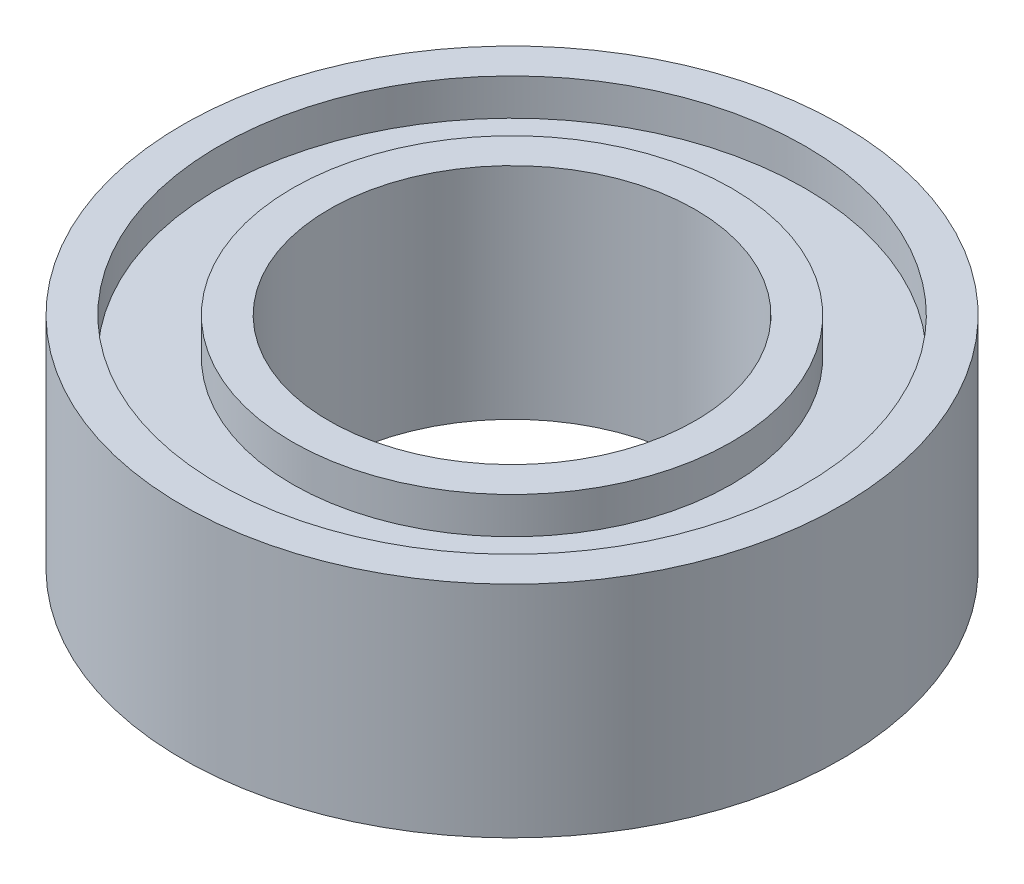
ISO-10303-21;
HEADER;
FILE_DESCRIPTION(('STEP AP214'),'2;1');
FILE_NAME('part.step','',(''),(''),'','','');
FILE_SCHEMA(('AUTOMOTIVE_DESIGN { 1 0 10303 214 1 1 1 1 }'));
ENDSEC;
DATA;
#1=APPLICATION_CONTEXT('core data for automotive mechanical design processes');
#2=APPLICATION_PROTOCOL_DEFINITION('international standard','automotive_design',2000,#1);
#3=PRODUCT_CONTEXT('',#1,'mechanical');
#4=PRODUCT('Part','Part','',(#3));
#5=PRODUCT_RELATED_PRODUCT_CATEGORY('part','',(#4));
#6=PRODUCT_DEFINITION_FORMATION('','',#4);
#7=PRODUCT_DEFINITION_CONTEXT('part definition',#1,'design');
#8=PRODUCT_DEFINITION('design','',#6,#7);
#9=PRODUCT_DEFINITION_SHAPE('','',#8);
#10=(LENGTH_UNIT() NAMED_UNIT(*) SI_UNIT(.MILLI.,.METRE.));
#11=(NAMED_UNIT(*) PLANE_ANGLE_UNIT() SI_UNIT($,.RADIAN.));
#12=(NAMED_UNIT(*) SI_UNIT($,.STERADIAN.) SOLID_ANGLE_UNIT());
#13=UNCERTAINTY_MEASURE_WITH_UNIT(LENGTH_MEASURE(1.E-05),#10,'distance_accuracy_value','');
#14=(GEOMETRIC_REPRESENTATION_CONTEXT(3) GLOBAL_UNCERTAINTY_ASSIGNED_CONTEXT((#13)) GLOBAL_UNIT_ASSIGNED_CONTEXT((#10,
#11,#12)) REPRESENTATION_CONTEXT('',''));
#15=CARTESIAN_POINT('',(0.,0.,0.));
#16=DIRECTION('',(0.,0.,1.));
#17=DIRECTION('',(1.,0.,0.));
#18=AXIS2_PLACEMENT_3D('',#15,#16,#17);
#19=CARTESIAN_POINT('',(0.,0.,0.));
#20=DIRECTION('',(0.,-1.,0.));
#21=DIRECTION('',(0.,0.,-1.));
#22=AXIS2_PLACEMENT_3D('',#19,#20,#21);
#23=CYLINDRICAL_SURFACE('',#22,2.5);
#24=CARTESIAN_POINT('',(0.,2.5,0.));
#25=DIRECTION('',(0.,-1.,0.));
#26=DIRECTION('',(0.,0.,-1.));
#27=AXIS2_PLACEMENT_3D('',#24,#25,#26);
#28=CIRCLE('',#27,2.5);
#29=CARTESIAN_POINT('',(0.,2.5,-2.5));
#30=VERTEX_POINT('',#29);
#31=EDGE_CURVE('E10',#30,#30,#28,.T.);
#32=ORIENTED_EDGE('',*,*,#31,.F.);
#33=EDGE_LOOP('',(#32));
#34=FACE_BOUND('',#33,.T.);
#35=CARTESIAN_POINT('',(0.,-0.500000000000003,0.));
#36=DIRECTION('',(0.,-1.,0.));
#37=DIRECTION('',(0.,0.,-1.));
#38=AXIS2_PLACEMENT_3D('',#35,#36,#37);
#39=CIRCLE('',#38,2.5);
#40=CARTESIAN_POINT('',(0.,-0.500000000000003,-2.5));
#41=VERTEX_POINT('',#40);
#42=EDGE_CURVE('E76',#41,#41,#39,.T.);
#43=ORIENTED_EDGE('',*,*,#42,.T.);
#44=EDGE_LOOP('',(#43));
#45=FACE_BOUND('',#44,.T.);
#46=ADVANCED_FACE('F36',(#34,#45),#23,.F.);
#47=CARTESIAN_POINT('',(-2.5,2.5,0.));
#48=DIRECTION('',(0.,-1.,0.));
#49=DIRECTION('',(0.,0.,-1.));
#50=AXIS2_PLACEMENT_3D('',#47,#48,#49);
#51=PLANE('',#50);
#52=CARTESIAN_POINT('',(0.,2.5,0.));
#53=DIRECTION('',(0.,-1.,0.));
#54=DIRECTION('',(0.,0.,-1.));
#55=AXIS2_PLACEMENT_3D('',#52,#53,#54);
#56=CIRCLE('',#55,3.);
#57=CARTESIAN_POINT('',(0.,2.5,-3.));
#58=VERTEX_POINT('',#57);
#59=EDGE_CURVE('E42',#58,#58,#56,.T.);
#60=ORIENTED_EDGE('',*,*,#59,.F.);
#61=EDGE_LOOP('',(#60));
#62=FACE_BOUND('',#61,.T.);
#63=ORIENTED_EDGE('',*,*,#31,.T.);
#64=EDGE_LOOP('',(#63));
#65=FACE_BOUND('',#64,.T.);
#66=ADVANCED_FACE('F137',(#62,#65),#51,.F.);
#67=CARTESIAN_POINT('',(0.,0.,0.));
#68=DIRECTION('',(0.,-1.,0.));
#69=DIRECTION('',(0.,0.,-1.));
#70=AXIS2_PLACEMENT_3D('',#67,#68,#69);
#71=CYLINDRICAL_SURFACE('',#70,3.);
#72=CARTESIAN_POINT('',(0.,2.,0.));
#73=DIRECTION('',(0.,-1.,0.));
#74=DIRECTION('',(0.,0.,-1.));
#75=AXIS2_PLACEMENT_3D('',#72,#73,#74);
#76=CIRCLE('',#75,3.);
#77=CARTESIAN_POINT('',(0.,2.,-3.));
#78=VERTEX_POINT('',#77);
#79=EDGE_CURVE('E46',#78,#78,#76,.T.);
#80=ORIENTED_EDGE('',*,*,#79,.F.);
#81=EDGE_LOOP('',(#80));
#82=FACE_BOUND('',#81,.T.);
#83=ORIENTED_EDGE('',*,*,#59,.T.);
#84=EDGE_LOOP('',(#83));
#85=FACE_BOUND('',#84,.T.);
#86=ADVANCED_FACE('F132',(#82,#85),#71,.T.);
#87=CARTESIAN_POINT('',(-3.,2.,0.));
#88=DIRECTION('',(0.,-1.,0.));
#89=DIRECTION('',(0.,0.,-1.));
#90=AXIS2_PLACEMENT_3D('',#87,#88,#89);
#91=PLANE('',#90);
#92=CARTESIAN_POINT('',(0.,2.,0.));
#93=DIRECTION('',(0.,-1.,0.));
#94=DIRECTION('',(0.,0.,-1.));
#95=AXIS2_PLACEMENT_3D('',#92,#93,#94);
#96=CIRCLE('',#95,4.);
#97=CARTESIAN_POINT('',(0.,2.,-4.));
#98=VERTEX_POINT('',#97);
#99=EDGE_CURVE('E50',#98,#98,#96,.T.);
#100=ORIENTED_EDGE('',*,*,#99,.F.);
#101=EDGE_LOOP('',(#100));
#102=FACE_BOUND('',#101,.T.);
#103=ORIENTED_EDGE('',*,*,#79,.T.);
#104=EDGE_LOOP('',(#103));
#105=FACE_BOUND('',#104,.T.);
#106=ADVANCED_FACE('F126',(#102,#105),#91,.F.);
#107=CARTESIAN_POINT('',(0.,0.,0.));
#108=DIRECTION('',(0.,-1.,0.));
#109=DIRECTION('',(0.,0.,-1.));
#110=AXIS2_PLACEMENT_3D('',#107,#108,#109);
#111=CYLINDRICAL_SURFACE('',#110,4.);
#112=CARTESIAN_POINT('',(0.,2.5,0.));
#113=DIRECTION('',(0.,-1.,0.));
#114=DIRECTION('',(0.,0.,-1.));
#115=AXIS2_PLACEMENT_3D('',#112,#113,#114);
#116=CIRCLE('',#115,4.);
#117=CARTESIAN_POINT('',(0.,2.5,-4.));
#118=VERTEX_POINT('',#117);
#119=EDGE_CURVE('E55',#118,#118,#116,.T.);
#120=ORIENTED_EDGE('',*,*,#119,.F.);
#121=EDGE_LOOP('',(#120));
#122=FACE_BOUND('',#121,.T.);
#123=ORIENTED_EDGE('',*,*,#99,.T.);
#124=EDGE_LOOP('',(#123));
#125=FACE_BOUND('',#124,.T.);
#126=ADVANCED_FACE('F120',(#122,#125),#111,.F.);
#127=CARTESIAN_POINT('',(-4.,2.5,0.));
#128=DIRECTION('',(0.,-1.,0.));
#129=DIRECTION('',(0.,0.,-1.));
#130=AXIS2_PLACEMENT_3D('',#127,#128,#129);
#131=PLANE('',#130);
#132=CARTESIAN_POINT('',(0.,2.5,0.));
#133=DIRECTION('',(0.,-1.,0.));
#134=DIRECTION('',(0.,0.,-1.));
#135=AXIS2_PLACEMENT_3D('',#132,#133,#134);
#136=CIRCLE('',#135,4.5);
#137=CARTESIAN_POINT('',(0.,2.5,-4.5));
#138=VERTEX_POINT('',#137);
#139=EDGE_CURVE('E58',#138,#138,#136,.T.);
#140=ORIENTED_EDGE('',*,*,#139,.F.);
#141=EDGE_LOOP('',(#140));
#142=FACE_BOUND('',#141,.T.);
#143=ORIENTED_EDGE('',*,*,#119,.T.);
#144=EDGE_LOOP('',(#143));
#145=FACE_BOUND('',#144,.T.);
#146=ADVANCED_FACE('F114',(#142,#145),#131,.F.);
#147=CARTESIAN_POINT('',(0.,0.,0.));
#148=DIRECTION('',(0.,-1.,0.));
#149=DIRECTION('',(0.,0.,-1.));
#150=AXIS2_PLACEMENT_3D('',#147,#148,#149);
#151=CYLINDRICAL_SURFACE('',#150,4.5);
#152=CARTESIAN_POINT('',(0.,-0.500000000000003,0.));
#153=DIRECTION('',(0.,-1.,0.));
#154=DIRECTION('',(0.,0.,-1.));
#155=AXIS2_PLACEMENT_3D('',#152,#153,#154);
#156=CIRCLE('',#155,4.5);
#157=CARTESIAN_POINT('',(0.,-0.500000000000003,-4.5));
#158=VERTEX_POINT('',#157);
#159=EDGE_CURVE('E61',#158,#158,#156,.T.);
#160=ORIENTED_EDGE('',*,*,#159,.F.);
#161=EDGE_LOOP('',(#160));
#162=FACE_BOUND('',#161,.T.);
#163=ORIENTED_EDGE('',*,*,#139,.T.);
#164=EDGE_LOOP('',(#163));
#165=FACE_BOUND('',#164,.T.);
#166=ADVANCED_FACE('F108',(#162,#165),#151,.T.);
#167=CARTESIAN_POINT('',(-4.5,-0.500000000000003,0.));
#168=DIRECTION('',(0.,1.,0.));
#169=DIRECTION('',(0.,0.,1.));
#170=AXIS2_PLACEMENT_3D('',#167,#168,#169);
#171=PLANE('',#170);
#172=CARTESIAN_POINT('',(0.,-0.500000000000003,0.));
#173=DIRECTION('',(0.,-1.,0.));
#174=DIRECTION('',(0.,0.,-1.));
#175=AXIS2_PLACEMENT_3D('',#172,#173,#174);
#176=CIRCLE('',#175,4.);
#177=CARTESIAN_POINT('',(0.,-0.500000000000003,-4.));
#178=VERTEX_POINT('',#177);
#179=EDGE_CURVE('E64',#178,#178,#176,.T.);
#180=ORIENTED_EDGE('',*,*,#179,.F.);
#181=EDGE_LOOP('',(#180));
#182=FACE_BOUND('',#181,.T.);
#183=ORIENTED_EDGE('',*,*,#159,.T.);
#184=EDGE_LOOP('',(#183));
#185=FACE_BOUND('',#184,.T.);
#186=ADVANCED_FACE('F102',(#182,#185),#171,.F.);
#187=CARTESIAN_POINT('',(0.,0.,0.));
#188=DIRECTION('',(0.,-1.,0.));
#189=DIRECTION('',(0.,0.,-1.));
#190=AXIS2_PLACEMENT_3D('',#187,#188,#189);
#191=CYLINDRICAL_SURFACE('',#190,4.);
#192=CARTESIAN_POINT('',(0.,0.,0.));
#193=DIRECTION('',(0.,-1.,0.));
#194=DIRECTION('',(0.,0.,-1.));
#195=AXIS2_PLACEMENT_3D('',#192,#193,#194);
#196=CIRCLE('',#195,4.);
#197=CARTESIAN_POINT('',(0.,0.,-4.));
#198=VERTEX_POINT('',#197);
#199=EDGE_CURVE('E67',#198,#198,#196,.T.);
#200=ORIENTED_EDGE('',*,*,#199,.F.);
#201=EDGE_LOOP('',(#200));
#202=FACE_BOUND('',#201,.T.);
#203=ORIENTED_EDGE('',*,*,#179,.T.);
#204=EDGE_LOOP('',(#203));
#205=FACE_BOUND('',#204,.T.);
#206=ADVANCED_FACE('F96',(#202,#205),#191,.F.);
#207=CARTESIAN_POINT('',(-4.,0.,0.));
#208=DIRECTION('',(0.,1.,0.));
#209=DIRECTION('',(0.,0.,1.));
#210=AXIS2_PLACEMENT_3D('',#207,#208,#209);
#211=PLANE('',#210);
#212=CARTESIAN_POINT('',(0.,0.,0.));
#213=DIRECTION('',(0.,-1.,0.));
#214=DIRECTION('',(0.,0.,-1.));
#215=AXIS2_PLACEMENT_3D('',#212,#213,#214);
#216=CIRCLE('',#215,3.);
#217=CARTESIAN_POINT('',(0.,0.,-3.));
#218=VERTEX_POINT('',#217);
#219=EDGE_CURVE('E70',#218,#218,#216,.T.);
#220=ORIENTED_EDGE('',*,*,#219,.F.);
#221=EDGE_LOOP('',(#220));
#222=FACE_BOUND('',#221,.T.);
#223=ORIENTED_EDGE('',*,*,#199,.T.);
#224=EDGE_LOOP('',(#223));
#225=FACE_BOUND('',#224,.T.);
#226=ADVANCED_FACE('F90',(#222,#225),#211,.F.);
#227=CARTESIAN_POINT('',(0.,0.,0.));
#228=DIRECTION('',(0.,-1.,0.));
#229=DIRECTION('',(0.,0.,-1.));
#230=AXIS2_PLACEMENT_3D('',#227,#228,#229);
#231=CYLINDRICAL_SURFACE('',#230,3.);
#232=CARTESIAN_POINT('',(0.,-0.5,0.));
#233=DIRECTION('',(0.,-1.,0.));
#234=DIRECTION('',(0.,0.,-1.));
#235=AXIS2_PLACEMENT_3D('',#232,#233,#234);
#236=CIRCLE('',#235,3.);
#237=CARTESIAN_POINT('',(0.,-0.5,-3.));
#238=VERTEX_POINT('',#237);
#239=EDGE_CURVE('E73',#238,#238,#236,.T.);
#240=ORIENTED_EDGE('',*,*,#239,.F.);
#241=EDGE_LOOP('',(#240));
#242=FACE_BOUND('',#241,.T.);
#243=ORIENTED_EDGE('',*,*,#219,.T.);
#244=EDGE_LOOP('',(#243));
#245=FACE_BOUND('',#244,.T.);
#246=ADVANCED_FACE('F84',(#242,#245),#231,.T.);
#247=CARTESIAN_POINT('',(-3.,-0.500000000000002,0.));
#248=DIRECTION('',(0.,1.,0.));
#249=DIRECTION('',(0.,0.,1.));
#250=AXIS2_PLACEMENT_3D('',#247,#248,#249);
#251=PLANE('',#250);
#252=ORIENTED_EDGE('',*,*,#42,.F.);
#253=EDGE_LOOP('',(#252));
#254=FACE_BOUND('',#253,.T.);
#255=ORIENTED_EDGE('',*,*,#239,.T.);
#256=EDGE_LOOP('',(#255));
#257=FACE_BOUND('',#256,.T.);
#258=ADVANCED_FACE('F81',(#254,#257),#251,.F.);
#259=CLOSED_SHELL('',(#46,#66,#86,#106,#126,#146,#166,#186,#206,#226,#246,#258));
#260=MANIFOLD_SOLID_BREP('B2',#259);
#261=ADVANCED_BREP_SHAPE_REPRESENTATION('',(#18,#260),#14);
#262=SHAPE_DEFINITION_REPRESENTATION(#9,#261);
ENDSEC;
END-ISO-10303-21;
